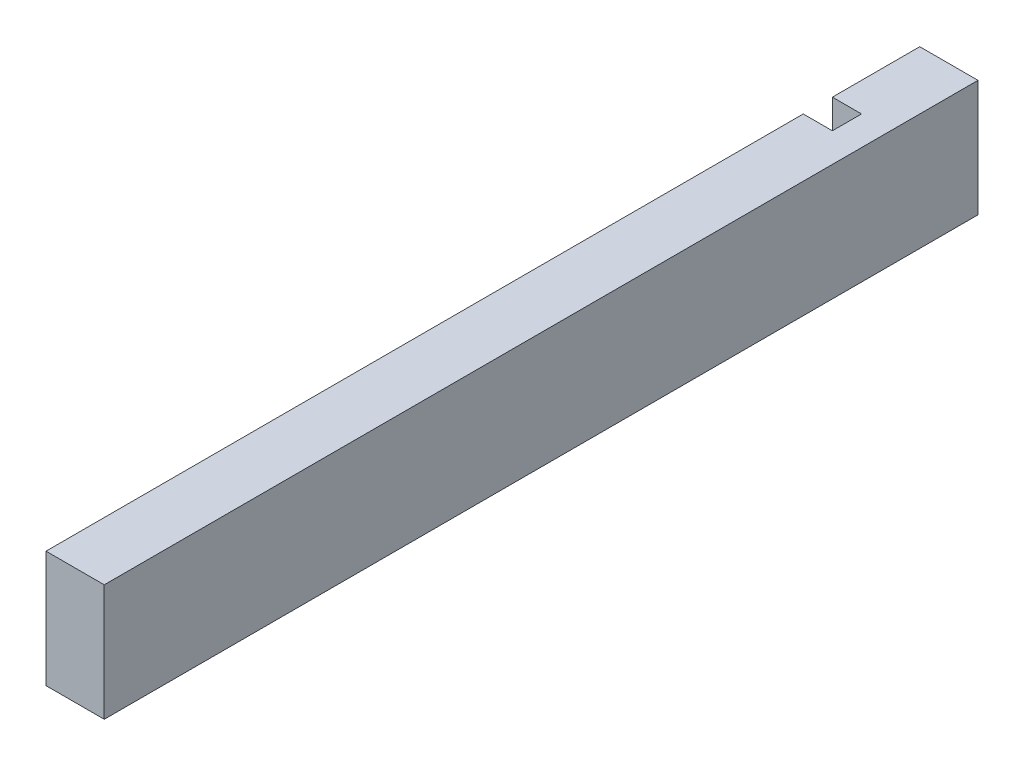
ISO-10303-21;
HEADER;
FILE_DESCRIPTION(('STEP AP214'),'2;1');
FILE_NAME('part.step','',(''),(''),'','','');
FILE_SCHEMA(('AUTOMOTIVE_DESIGN { 1 0 10303 214 1 1 1 1 }'));
ENDSEC;
DATA;
#1=APPLICATION_CONTEXT('core data for automotive mechanical design processes');
#2=APPLICATION_PROTOCOL_DEFINITION('international standard','automotive_design',2000,#1);
#3=PRODUCT_CONTEXT('',#1,'mechanical');
#4=PRODUCT('Part','Part','',(#3));
#5=PRODUCT_RELATED_PRODUCT_CATEGORY('part','',(#4));
#6=PRODUCT_DEFINITION_FORMATION('','',#4);
#7=PRODUCT_DEFINITION_CONTEXT('part definition',#1,'design');
#8=PRODUCT_DEFINITION('design','',#6,#7);
#9=PRODUCT_DEFINITION_SHAPE('','',#8);
#10=(LENGTH_UNIT() NAMED_UNIT(*) SI_UNIT(.MILLI.,.METRE.));
#11=(NAMED_UNIT(*) PLANE_ANGLE_UNIT() SI_UNIT($,.RADIAN.));
#12=(NAMED_UNIT(*) SI_UNIT($,.STERADIAN.) SOLID_ANGLE_UNIT());
#13=UNCERTAINTY_MEASURE_WITH_UNIT(LENGTH_MEASURE(1.E-05),#10,'distance_accuracy_value','');
#14=(GEOMETRIC_REPRESENTATION_CONTEXT(3) GLOBAL_UNCERTAINTY_ASSIGNED_CONTEXT((#13)) GLOBAL_UNIT_ASSIGNED_CONTEXT((#10,
#11,#12)) REPRESENTATION_CONTEXT('',''));
#15=CARTESIAN_POINT('',(0.,0.,0.));
#16=DIRECTION('',(0.,0.,1.));
#17=DIRECTION('',(1.,0.,0.));
#18=AXIS2_PLACEMENT_3D('',#15,#16,#17);
#19=CARTESIAN_POINT('',(0.,0.,300.));
#20=DIRECTION('',(1.,0.,0.));
#21=DIRECTION('',(0.,0.,-1.));
#22=AXIS2_PLACEMENT_3D('',#19,#20,#21);
#23=PLANE('',#22);
#24=DIRECTION('',(0.,1.,0.));
#25=VECTOR('',#24,1.);
#26=CARTESIAN_POINT('',(0.,-379.143772202578,30.));
#27=LINE('',#26,#25);
#28=CARTESIAN_POINT('',(0.,0.,30.));
#29=VERTEX_POINT('',#28);
#30=CARTESIAN_POINT('',(0.,40.,30.));
#31=VERTEX_POINT('',#30);
#32=EDGE_CURVE('E119',#29,#31,#27,.T.);
#33=ORIENTED_EDGE('',*,*,#32,.T.);
#34=DIRECTION('',(0.,0.,-1.));
#35=VECTOR('',#34,1.);
#36=CARTESIAN_POINT('',(0.,40.,300.));
#37=LINE('',#36,#35);
#38=CARTESIAN_POINT('',(0.,40.,0.));
#39=VERTEX_POINT('',#38);
#40=EDGE_CURVE('E136',#31,#39,#37,.T.);
#41=ORIENTED_EDGE('',*,*,#40,.T.);
#42=DIRECTION('',(0.,-1.,0.));
#43=VECTOR('',#42,1.);
#44=CARTESIAN_POINT('',(0.,0.,0.));
#45=LINE('',#44,#43);
#46=CARTESIAN_POINT('',(0.,0.,0.));
#47=VERTEX_POINT('',#46);
#48=EDGE_CURVE('E125',#39,#47,#45,.T.);
#49=ORIENTED_EDGE('',*,*,#48,.T.);
#50=DIRECTION('',(0.,0.,-1.));
#51=VECTOR('',#50,1.);
#52=CARTESIAN_POINT('',(0.,0.,300.));
#53=LINE('',#52,#51);
#54=EDGE_CURVE('E153',#29,#47,#53,.T.);
#55=ORIENTED_EDGE('',*,*,#54,.F.);
#56=EDGE_LOOP('',(#33,#41,#49,#55));
#57=FACE_BOUND('',#56,.T.);
#58=ADVANCED_FACE('F33',(#57),#23,.F.);
#59=DIRECTION('',(0.,1.,0.));
#60=VECTOR('',#59,1.);
#61=CARTESIAN_POINT('',(0.,-379.143772202578,40.));
#62=LINE('',#61,#60);
#63=CARTESIAN_POINT('',(0.,0.,40.));
#64=VERTEX_POINT('',#63);
#65=CARTESIAN_POINT('',(0.,40.,40.));
#66=VERTEX_POINT('',#65);
#67=EDGE_CURVE('E110',#64,#66,#62,.T.);
#68=ORIENTED_EDGE('',*,*,#67,.F.);
#69=CARTESIAN_POINT('',(0.,0.,300.));
#70=VERTEX_POINT('',#69);
#71=EDGE_CURVE('E111',#70,#64,#53,.T.);
#72=ORIENTED_EDGE('',*,*,#71,.F.);
#73=DIRECTION('',(0.,-1.,0.));
#74=VECTOR('',#73,1.);
#75=CARTESIAN_POINT('',(0.,0.,300.));
#76=LINE('',#75,#74);
#77=CARTESIAN_POINT('',(0.,40.,300.));
#78=VERTEX_POINT('',#77);
#79=EDGE_CURVE('E126',#78,#70,#76,.T.);
#80=ORIENTED_EDGE('',*,*,#79,.F.);
#81=EDGE_CURVE('E145',#78,#66,#37,.T.);
#82=ORIENTED_EDGE('',*,*,#81,.T.);
#83=EDGE_LOOP('',(#68,#72,#80,#82));
#84=FACE_BOUND('',#83,.T.);
#85=ADVANCED_FACE('F175',(#84),#23,.F.);
#86=CARTESIAN_POINT('',(0.,0.,300.));
#87=DIRECTION('',(0.,1.,0.));
#88=DIRECTION('',(0.,0.,1.));
#89=AXIS2_PLACEMENT_3D('',#86,#87,#88);
#90=PLANE('',#89);
#91=DIRECTION('',(1.,0.,0.));
#92=VECTOR('',#91,1.);
#93=CARTESIAN_POINT('',(0.,0.,30.));
#94=LINE('',#93,#92);
#95=CARTESIAN_POINT('',(10.,0.,30.));
#96=VERTEX_POINT('',#95);
#97=EDGE_CURVE('E123',#29,#96,#94,.T.);
#98=ORIENTED_EDGE('',*,*,#97,.F.);
#99=ORIENTED_EDGE('',*,*,#54,.T.);
#100=DIRECTION('',(1.,0.,0.));
#101=VECTOR('',#100,1.);
#102=CARTESIAN_POINT('',(0.,0.,0.));
#103=LINE('',#102,#101);
#104=CARTESIAN_POINT('',(20.,0.,0.));
#105=VERTEX_POINT('',#104);
#106=EDGE_CURVE('E139',#47,#105,#103,.T.);
#107=ORIENTED_EDGE('',*,*,#106,.T.);
#108=DIRECTION('',(0.,0.,-1.));
#109=VECTOR('',#108,1.);
#110=CARTESIAN_POINT('',(20.,0.,300.));
#111=LINE('',#110,#109);
#112=CARTESIAN_POINT('',(20.,0.,300.));
#113=VERTEX_POINT('',#112);
#114=EDGE_CURVE('E150',#113,#105,#111,.T.);
#115=ORIENTED_EDGE('',*,*,#114,.F.);
#116=DIRECTION('',(1.,0.,0.));
#117=VECTOR('',#116,1.);
#118=CARTESIAN_POINT('',(0.,0.,300.));
#119=LINE('',#118,#117);
#120=EDGE_CURVE('E129',#70,#113,#119,.T.);
#121=ORIENTED_EDGE('',*,*,#120,.F.);
#122=ORIENTED_EDGE('',*,*,#71,.T.);
#123=DIRECTION('',(-1.,0.,0.));
#124=VECTOR('',#123,1.);
#125=CARTESIAN_POINT('',(0.,0.,40.));
#126=LINE('',#125,#124);
#127=CARTESIAN_POINT('',(10.,0.,40.));
#128=VERTEX_POINT('',#127);
#129=EDGE_CURVE('E52',#128,#64,#126,.T.);
#130=ORIENTED_EDGE('',*,*,#129,.F.);
#131=DIRECTION('',(0.,0.,1.));
#132=VECTOR('',#131,1.);
#133=CARTESIAN_POINT('',(10.,0.,300.));
#134=LINE('',#133,#132);
#135=EDGE_CURVE('E47',#96,#128,#134,.T.);
#136=ORIENTED_EDGE('',*,*,#135,.F.);
#137=EDGE_LOOP('',(#98,#99,#107,#115,#121,#122,#130,#136));
#138=FACE_BOUND('',#137,.T.);
#139=ADVANCED_FACE('F157',(#138),#90,.F.);
#140=CARTESIAN_POINT('',(0.,40.,300.));
#141=DIRECTION('',(0.,-1.,0.));
#142=DIRECTION('',(0.,0.,-1.));
#143=AXIS2_PLACEMENT_3D('',#140,#141,#142);
#144=PLANE('',#143);
#145=DIRECTION('',(-1.,0.,0.));
#146=VECTOR('',#145,1.);
#147=CARTESIAN_POINT('',(0.,40.,30.));
#148=LINE('',#147,#146);
#149=CARTESIAN_POINT('',(10.,40.,30.));
#150=VERTEX_POINT('',#149);
#151=EDGE_CURVE('E11',#150,#31,#148,.T.);
#152=ORIENTED_EDGE('',*,*,#151,.F.);
#153=DIRECTION('',(0.,0.,-1.));
#154=VECTOR('',#153,1.);
#155=CARTESIAN_POINT('',(10.,40.,300.));
#156=LINE('',#155,#154);
#157=CARTESIAN_POINT('',(10.,40.,40.));
#158=VERTEX_POINT('',#157);
#159=EDGE_CURVE('E40',#158,#150,#156,.T.);
#160=ORIENTED_EDGE('',*,*,#159,.F.);
#161=DIRECTION('',(1.,0.,0.));
#162=VECTOR('',#161,1.);
#163=CARTESIAN_POINT('',(0.,40.,40.));
#164=LINE('',#163,#162);
#165=EDGE_CURVE('E98',#66,#158,#164,.T.);
#166=ORIENTED_EDGE('',*,*,#165,.F.);
#167=ORIENTED_EDGE('',*,*,#81,.F.);
#168=DIRECTION('',(-1.,0.,0.));
#169=VECTOR('',#168,1.);
#170=CARTESIAN_POINT('',(0.,40.,300.));
#171=LINE('',#170,#169);
#172=CARTESIAN_POINT('',(20.,40.,300.));
#173=VERTEX_POINT('',#172);
#174=EDGE_CURVE('E134',#173,#78,#171,.T.);
#175=ORIENTED_EDGE('',*,*,#174,.F.);
#176=DIRECTION('',(0.,0.,-1.));
#177=VECTOR('',#176,1.);
#178=CARTESIAN_POINT('',(20.,40.,300.));
#179=LINE('',#178,#177);
#180=CARTESIAN_POINT('',(20.,40.,0.));
#181=VERTEX_POINT('',#180);
#182=EDGE_CURVE('E147',#173,#181,#179,.T.);
#183=ORIENTED_EDGE('',*,*,#182,.T.);
#184=DIRECTION('',(-1.,0.,0.));
#185=VECTOR('',#184,1.);
#186=CARTESIAN_POINT('',(0.,40.,0.));
#187=LINE('',#186,#185);
#188=EDGE_CURVE('E130',#181,#39,#187,.T.);
#189=ORIENTED_EDGE('',*,*,#188,.T.);
#190=ORIENTED_EDGE('',*,*,#40,.F.);
#191=EDGE_LOOP('',(#152,#160,#166,#167,#175,#183,#189,#190));
#192=FACE_BOUND('',#191,.T.);
#193=ADVANCED_FACE('F96',(#192),#144,.F.);
#194=CARTESIAN_POINT('',(20.,0.,300.));
#195=DIRECTION('',(-1.,0.,0.));
#196=DIRECTION('',(0.,0.,1.));
#197=AXIS2_PLACEMENT_3D('',#194,#195,#196);
#198=PLANE('',#197);
#199=DIRECTION('',(0.,1.,0.));
#200=VECTOR('',#199,1.);
#201=CARTESIAN_POINT('',(20.,0.,0.));
#202=LINE('',#201,#200);
#203=EDGE_CURVE('E141',#105,#181,#202,.T.);
#204=ORIENTED_EDGE('',*,*,#203,.T.);
#205=ORIENTED_EDGE('',*,*,#182,.F.);
#206=DIRECTION('',(0.,1.,0.));
#207=VECTOR('',#206,1.);
#208=CARTESIAN_POINT('',(20.,0.,300.));
#209=LINE('',#208,#207);
#210=EDGE_CURVE('E132',#113,#173,#209,.T.);
#211=ORIENTED_EDGE('',*,*,#210,.F.);
#212=ORIENTED_EDGE('',*,*,#114,.T.);
#213=EDGE_LOOP('',(#204,#205,#211,#212));
#214=FACE_BOUND('',#213,.T.);
#215=ADVANCED_FACE('F170',(#214),#198,.F.);
#216=CARTESIAN_POINT('',(0.,40.,300.));
#217=DIRECTION('',(0.,0.,-1.));
#218=DIRECTION('',(-1.,0.,0.));
#219=AXIS2_PLACEMENT_3D('',#216,#217,#218);
#220=PLANE('',#219);
#221=ORIENTED_EDGE('',*,*,#79,.T.);
#222=ORIENTED_EDGE('',*,*,#120,.T.);
#223=ORIENTED_EDGE('',*,*,#210,.T.);
#224=ORIENTED_EDGE('',*,*,#174,.T.);
#225=EDGE_LOOP('',(#221,#222,#223,#224));
#226=FACE_BOUND('',#225,.T.);
#227=ADVANCED_FACE('F173',(#226),#220,.F.);
#228=CARTESIAN_POINT('',(0.,40.,0.));
#229=DIRECTION('',(0.,0.,-1.));
#230=DIRECTION('',(-1.,0.,0.));
#231=AXIS2_PLACEMENT_3D('',#228,#229,#230);
#232=PLANE('',#231);
#233=ORIENTED_EDGE('',*,*,#48,.F.);
#234=ORIENTED_EDGE('',*,*,#188,.F.);
#235=ORIENTED_EDGE('',*,*,#203,.F.);
#236=ORIENTED_EDGE('',*,*,#106,.F.);
#237=EDGE_LOOP('',(#233,#234,#235,#236));
#238=FACE_BOUND('',#237,.T.);
#239=ADVANCED_FACE('F164',(#238),#232,.T.);
#240=CARTESIAN_POINT('',(0.,-379.143772202578,30.));
#241=DIRECTION('',(0.,0.,1.));
#242=DIRECTION('',(1.,0.,0.));
#243=AXIS2_PLACEMENT_3D('',#240,#241,#242);
#244=PLANE('',#243);
#245=ORIENTED_EDGE('',*,*,#32,.F.);
#246=ORIENTED_EDGE('',*,*,#97,.T.);
#247=DIRECTION('',(0.,1.,0.));
#248=VECTOR('',#247,1.);
#249=CARTESIAN_POINT('',(10.,-379.143772202578,30.));
#250=LINE('',#249,#248);
#251=EDGE_CURVE('E115',#96,#150,#250,.T.);
#252=ORIENTED_EDGE('',*,*,#251,.T.);
#253=ORIENTED_EDGE('',*,*,#151,.T.);
#254=EDGE_LOOP('',(#245,#246,#252,#253));
#255=FACE_BOUND('',#254,.T.);
#256=ADVANCED_FACE('F213',(#255),#244,.T.);
#257=CARTESIAN_POINT('',(10.,-379.143772202578,30.));
#258=DIRECTION('',(-1.,0.,0.));
#259=DIRECTION('',(0.,0.,1.));
#260=AXIS2_PLACEMENT_3D('',#257,#258,#259);
#261=PLANE('',#260);
#262=ORIENTED_EDGE('',*,*,#251,.F.);
#263=ORIENTED_EDGE('',*,*,#135,.T.);
#264=DIRECTION('',(0.,1.,0.));
#265=VECTOR('',#264,1.);
#266=CARTESIAN_POINT('',(10.,-379.143772202578,40.));
#267=LINE('',#266,#265);
#268=EDGE_CURVE('E109',#128,#158,#267,.T.);
#269=ORIENTED_EDGE('',*,*,#268,.T.);
#270=ORIENTED_EDGE('',*,*,#159,.T.);
#271=EDGE_LOOP('',(#262,#263,#269,#270));
#272=FACE_BOUND('',#271,.T.);
#273=ADVANCED_FACE('F113',(#272),#261,.T.);
#274=CARTESIAN_POINT('',(10.,-379.143772202578,40.));
#275=DIRECTION('',(0.,0.,-1.));
#276=DIRECTION('',(-1.,0.,0.));
#277=AXIS2_PLACEMENT_3D('',#274,#275,#276);
#278=PLANE('',#277);
#279=ORIENTED_EDGE('',*,*,#268,.F.);
#280=ORIENTED_EDGE('',*,*,#129,.T.);
#281=ORIENTED_EDGE('',*,*,#67,.T.);
#282=ORIENTED_EDGE('',*,*,#165,.T.);
#283=EDGE_LOOP('',(#279,#280,#281,#282));
#284=FACE_BOUND('',#283,.T.);
#285=ADVANCED_FACE('F108',(#284),#278,.T.);
#286=CLOSED_SHELL('',(#58,#85,#139,#193,#215,#227,#239,#256,#273,#285));
#287=MANIFOLD_SOLID_BREP('B2',#286);
#288=ADVANCED_BREP_SHAPE_REPRESENTATION('',(#18,#287),#14);
#289=SHAPE_DEFINITION_REPRESENTATION(#9,#288);
ENDSEC;
END-ISO-10303-21;
